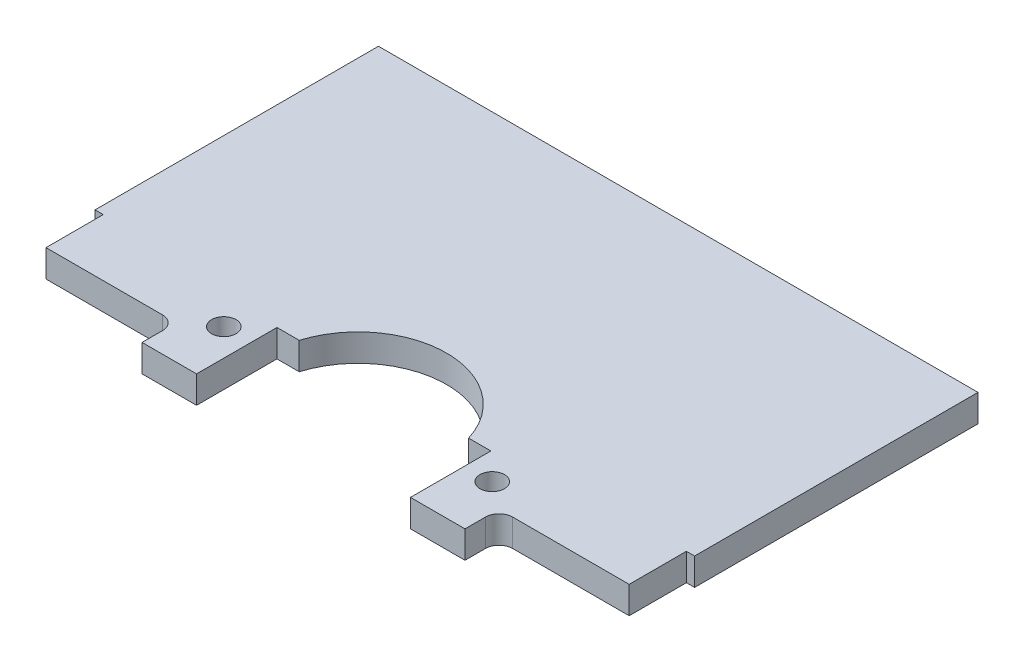
ISO-10303-21;
HEADER;
FILE_DESCRIPTION(('STEP AP214'),'2;1');
FILE_NAME('part.step','',(''),(''),'','','');
FILE_SCHEMA(('AUTOMOTIVE_DESIGN { 1 0 10303 214 1 1 1 1 }'));
ENDSEC;
DATA;
#1=APPLICATION_CONTEXT('core data for automotive mechanical design processes');
#2=APPLICATION_PROTOCOL_DEFINITION('international standard','automotive_design',2000,#1);
#3=PRODUCT_CONTEXT('',#1,'mechanical');
#4=PRODUCT('Part','Part','',(#3));
#5=PRODUCT_RELATED_PRODUCT_CATEGORY('part','',(#4));
#6=PRODUCT_DEFINITION_FORMATION('','',#4);
#7=PRODUCT_DEFINITION_CONTEXT('part definition',#1,'design');
#8=PRODUCT_DEFINITION('design','',#6,#7);
#9=PRODUCT_DEFINITION_SHAPE('','',#8);
#10=(LENGTH_UNIT() NAMED_UNIT(*) SI_UNIT(.MILLI.,.METRE.));
#11=(NAMED_UNIT(*) PLANE_ANGLE_UNIT() SI_UNIT($,.RADIAN.));
#12=(NAMED_UNIT(*) SI_UNIT($,.STERADIAN.) SOLID_ANGLE_UNIT());
#13=UNCERTAINTY_MEASURE_WITH_UNIT(LENGTH_MEASURE(1.E-05),#10,'distance_accuracy_value','');
#14=(GEOMETRIC_REPRESENTATION_CONTEXT(3) GLOBAL_UNCERTAINTY_ASSIGNED_CONTEXT((#13)) GLOBAL_UNIT_ASSIGNED_CONTEXT((#10,
#11,#12)) REPRESENTATION_CONTEXT('',''));
#15=CARTESIAN_POINT('',(0.,0.,0.));
#16=DIRECTION('',(0.,0.,1.));
#17=DIRECTION('',(1.,0.,0.));
#18=AXIS2_PLACEMENT_3D('',#15,#16,#17);
#19=CARTESIAN_POINT('',(0.,2.54,13.208));
#20=DIRECTION('',(0.,0.,-1.));
#21=DIRECTION('',(-1.,0.,0.));
#22=AXIS2_PLACEMENT_3D('',#19,#20,#21);
#23=PLANE('',#22);
#24=DIRECTION('',(1.,0.,0.));
#25=VECTOR('',#24,1.);
#26=CARTESIAN_POINT('',(0.,0.,13.208));
#27=LINE('',#26,#25);
#28=CARTESIAN_POINT('',(-27.94,0.,13.208));
#29=VERTEX_POINT('',#28);
#30=CARTESIAN_POINT('',(-27.178,0.,13.208));
#31=VERTEX_POINT('',#30);
#32=EDGE_CURVE('E191',#29,#31,#27,.T.);
#33=ORIENTED_EDGE('',*,*,#32,.T.);
#34=DIRECTION('',(0.,-1.,0.));
#35=VECTOR('',#34,1.);
#36=CARTESIAN_POINT('',(-27.178,2.54,13.208));
#37=LINE('',#36,#35);
#38=CARTESIAN_POINT('',(-27.178,2.54,13.208));
#39=VERTEX_POINT('',#38);
#40=EDGE_CURVE('E189',#39,#31,#37,.T.);
#41=ORIENTED_EDGE('',*,*,#40,.F.);
#42=DIRECTION('',(1.,0.,0.));
#43=VECTOR('',#42,1.);
#44=CARTESIAN_POINT('',(0.,2.54,13.208));
#45=LINE('',#44,#43);
#46=CARTESIAN_POINT('',(-27.94,2.54,13.208));
#47=VERTEX_POINT('',#46);
#48=EDGE_CURVE('E174',#47,#39,#45,.T.);
#49=ORIENTED_EDGE('',*,*,#48,.F.);
#50=DIRECTION('',(0.,-1.,0.));
#51=VECTOR('',#50,1.);
#52=CARTESIAN_POINT('',(-27.94,2.54,13.208));
#53=LINE('',#52,#51);
#54=EDGE_CURVE('E239',#47,#29,#53,.T.);
#55=ORIENTED_EDGE('',*,*,#54,.T.);
#56=EDGE_LOOP('',(#33,#41,#49,#55));
#57=FACE_BOUND('',#56,.T.);
#58=ADVANCED_FACE('F36',(#57),#23,.F.);
#59=CARTESIAN_POINT('',(-27.178,2.54,0.));
#60=DIRECTION('',(-1.,0.,0.));
#61=DIRECTION('',(0.,0.,1.));
#62=AXIS2_PLACEMENT_3D('',#59,#60,#61);
#63=PLANE('',#62);
#64=DIRECTION('',(0.,0.,-1.));
#65=VECTOR('',#64,1.);
#66=CARTESIAN_POINT('',(-27.178,0.,0.));
#67=LINE('',#66,#65);
#68=CARTESIAN_POINT('',(-27.178,0.,18.542));
#69=VERTEX_POINT('',#68);
#70=EDGE_CURVE('E241',#69,#31,#67,.T.);
#71=ORIENTED_EDGE('',*,*,#70,.F.);
#72=DIRECTION('',(0.,-1.,0.));
#73=VECTOR('',#72,1.);
#74=CARTESIAN_POINT('',(-27.178,2.54,18.542));
#75=LINE('',#74,#73);
#76=CARTESIAN_POINT('',(-27.178,2.54,18.542));
#77=VERTEX_POINT('',#76);
#78=EDGE_CURVE('E196',#77,#69,#75,.T.);
#79=ORIENTED_EDGE('',*,*,#78,.F.);
#80=DIRECTION('',(0.,0.,-1.));
#81=VECTOR('',#80,1.);
#82=CARTESIAN_POINT('',(-27.178,2.54,0.));
#83=LINE('',#82,#81);
#84=EDGE_CURVE('E180',#77,#39,#83,.T.);
#85=ORIENTED_EDGE('',*,*,#84,.T.);
#86=ORIENTED_EDGE('',*,*,#40,.T.);
#87=EDGE_LOOP('',(#71,#79,#85,#86));
#88=FACE_BOUND('',#87,.T.);
#89=ADVANCED_FACE('F198',(#88),#63,.T.);
#90=CARTESIAN_POINT('',(0.,2.54,18.542));
#91=DIRECTION('',(0.,0.,-1.));
#92=DIRECTION('',(-1.,0.,0.));
#93=AXIS2_PLACEMENT_3D('',#90,#91,#92);
#94=PLANE('',#93);
#95=DIRECTION('',(1.,0.,0.));
#96=VECTOR('',#95,1.);
#97=CARTESIAN_POINT('',(0.,0.,18.542));
#98=LINE('',#97,#96);
#99=CARTESIAN_POINT('',(-16.3195,0.,18.542));
#100=VERTEX_POINT('',#99);
#101=EDGE_CURVE('E244',#69,#100,#98,.T.);
#102=ORIENTED_EDGE('',*,*,#101,.T.);
#103=DIRECTION('',(0.,-1.,0.));
#104=VECTOR('',#103,1.);
#105=CARTESIAN_POINT('',(-16.3195,2.54,18.542));
#106=LINE('',#105,#104);
#107=CARTESIAN_POINT('',(-16.3195,2.54,18.542));
#108=VERTEX_POINT('',#107);
#109=EDGE_CURVE('E324',#100,#108,#106,.F.);
#110=ORIENTED_EDGE('',*,*,#109,.T.);
#111=DIRECTION('',(1.,0.,0.));
#112=VECTOR('',#111,1.);
#113=CARTESIAN_POINT('',(0.,2.54,18.542));
#114=LINE('',#113,#112);
#115=EDGE_CURVE('E200',#77,#108,#114,.T.);
#116=ORIENTED_EDGE('',*,*,#115,.F.);
#117=ORIENTED_EDGE('',*,*,#78,.T.);
#118=EDGE_LOOP('',(#102,#110,#116,#117));
#119=FACE_BOUND('',#118,.T.);
#120=ADVANCED_FACE('F348',(#119),#94,.F.);
#121=CARTESIAN_POINT('',(-15.0495,2.54,0.));
#122=DIRECTION('',(-1.,0.,0.));
#123=DIRECTION('',(0.,0.,1.));
#124=AXIS2_PLACEMENT_3D('',#121,#122,#123);
#125=PLANE('',#124);
#126=DIRECTION('',(0.,0.,-1.));
#127=VECTOR('',#126,1.);
#128=CARTESIAN_POINT('',(-15.0495,2.54,0.));
#129=LINE('',#128,#127);
#130=CARTESIAN_POINT('',(-15.0495,2.54,21.717));
#131=VERTEX_POINT('',#130);
#132=CARTESIAN_POINT('',(-15.0495,2.54,19.812));
#133=VERTEX_POINT('',#132);
#134=EDGE_CURVE('E202',#131,#133,#129,.T.);
#135=ORIENTED_EDGE('',*,*,#134,.T.);
#136=DIRECTION('',(0.,-1.,0.));
#137=VECTOR('',#136,1.);
#138=CARTESIAN_POINT('',(-15.0495,2.54,19.812));
#139=LINE('',#138,#137);
#140=CARTESIAN_POINT('',(-15.0495,0.,19.812));
#141=VERTEX_POINT('',#140);
#142=EDGE_CURVE('E195',#133,#141,#139,.T.);
#143=ORIENTED_EDGE('',*,*,#142,.T.);
#144=DIRECTION('',(0.,0.,-1.));
#145=VECTOR('',#144,1.);
#146=CARTESIAN_POINT('',(-15.0495,0.,0.));
#147=LINE('',#146,#145);
#148=CARTESIAN_POINT('',(-15.0495,0.,21.717));
#149=VERTEX_POINT('',#148);
#150=EDGE_CURVE('E247',#149,#141,#147,.T.);
#151=ORIENTED_EDGE('',*,*,#150,.F.);
#152=DIRECTION('',(0.,-1.,0.));
#153=VECTOR('',#152,1.);
#154=CARTESIAN_POINT('',(-15.0495,2.54,21.717));
#155=LINE('',#154,#153);
#156=EDGE_CURVE('E319',#131,#149,#155,.T.);
#157=ORIENTED_EDGE('',*,*,#156,.F.);
#158=EDGE_LOOP('',(#135,#143,#151,#157));
#159=FACE_BOUND('',#158,.T.);
#160=ADVANCED_FACE('F339',(#159),#125,.T.);
#161=CARTESIAN_POINT('',(0.,2.54,21.717));
#162=DIRECTION('',(0.,0.,-1.));
#163=DIRECTION('',(-1.,0.,0.));
#164=AXIS2_PLACEMENT_3D('',#161,#162,#163);
#165=PLANE('',#164);
#166=DIRECTION('',(1.,0.,0.));
#167=VECTOR('',#166,1.);
#168=CARTESIAN_POINT('',(0.,0.,21.717));
#169=LINE('',#168,#167);
#170=CARTESIAN_POINT('',(-9.9695,0.,21.717));
#171=VERTEX_POINT('',#170);
#172=EDGE_CURVE('E250',#149,#171,#169,.T.);
#173=ORIENTED_EDGE('',*,*,#172,.T.);
#174=DIRECTION('',(0.,-1.,0.));
#175=VECTOR('',#174,1.);
#176=CARTESIAN_POINT('',(-9.9695,2.54,21.717));
#177=LINE('',#176,#175);
#178=CARTESIAN_POINT('',(-9.9695,2.54,21.717));
#179=VERTEX_POINT('',#178);
#180=EDGE_CURVE('E316',#179,#171,#177,.T.);
#181=ORIENTED_EDGE('',*,*,#180,.F.);
#182=DIRECTION('',(1.,0.,0.));
#183=VECTOR('',#182,1.);
#184=CARTESIAN_POINT('',(0.,2.54,21.717));
#185=LINE('',#184,#183);
#186=EDGE_CURVE('E207',#131,#179,#185,.T.);
#187=ORIENTED_EDGE('',*,*,#186,.F.);
#188=ORIENTED_EDGE('',*,*,#156,.T.);
#189=EDGE_LOOP('',(#173,#181,#187,#188));
#190=FACE_BOUND('',#189,.T.);
#191=ADVANCED_FACE('F355',(#190),#165,.F.);
#192=CARTESIAN_POINT('',(-9.9695,2.54,0.));
#193=DIRECTION('',(-1.,0.,0.));
#194=DIRECTION('',(0.,0.,1.));
#195=AXIS2_PLACEMENT_3D('',#192,#193,#194);
#196=PLANE('',#195);
#197=DIRECTION('',(0.,0.,-1.));
#198=VECTOR('',#197,1.);
#199=CARTESIAN_POINT('',(-9.9695,0.,0.));
#200=LINE('',#199,#198);
#201=CARTESIAN_POINT('',(-9.9695,0.,14.224));
#202=VERTEX_POINT('',#201);
#203=EDGE_CURVE('E252',#171,#202,#200,.T.);
#204=ORIENTED_EDGE('',*,*,#203,.T.);
#205=DIRECTION('',(0.,-1.,0.));
#206=VECTOR('',#205,1.);
#207=CARTESIAN_POINT('',(-9.9695,2.54,14.224));
#208=LINE('',#207,#206);
#209=CARTESIAN_POINT('',(-9.9695,2.54,14.224));
#210=VERTEX_POINT('',#209);
#211=EDGE_CURVE('E313',#210,#202,#208,.T.);
#212=ORIENTED_EDGE('',*,*,#211,.F.);
#213=DIRECTION('',(0.,0.,-1.));
#214=VECTOR('',#213,1.);
#215=CARTESIAN_POINT('',(-9.9695,2.54,0.));
#216=LINE('',#215,#214);
#217=EDGE_CURVE('E209',#179,#210,#216,.T.);
#218=ORIENTED_EDGE('',*,*,#217,.F.);
#219=ORIENTED_EDGE('',*,*,#180,.T.);
#220=EDGE_LOOP('',(#204,#212,#218,#219));
#221=FACE_BOUND('',#220,.T.);
#222=ADVANCED_FACE('F530',(#221),#196,.F.);
#223=CARTESIAN_POINT('',(0.,2.54,14.224));
#224=DIRECTION('',(0.,0.,-1.));
#225=DIRECTION('',(-1.,0.,0.));
#226=AXIS2_PLACEMENT_3D('',#223,#224,#225);
#227=PLANE('',#226);
#228=DIRECTION('',(1.,0.,0.));
#229=VECTOR('',#228,1.);
#230=CARTESIAN_POINT('',(0.,0.,14.224));
#231=LINE('',#230,#229);
#232=CARTESIAN_POINT('',(-7.89445729610339,0.,14.224));
#233=VERTEX_POINT('',#232);
#234=EDGE_CURVE('E254',#202,#233,#231,.T.);
#235=ORIENTED_EDGE('',*,*,#234,.T.);
#236=DIRECTION('',(0.,-1.,0.));
#237=VECTOR('',#236,1.);
#238=CARTESIAN_POINT('',(-7.89445729610339,2.54,14.224));
#239=LINE('',#238,#237);
#240=CARTESIAN_POINT('',(-7.89445729610339,2.54,14.224));
#241=VERTEX_POINT('',#240);
#242=EDGE_CURVE('E310',#241,#233,#239,.T.);
#243=ORIENTED_EDGE('',*,*,#242,.F.);
#244=DIRECTION('',(1.,0.,0.));
#245=VECTOR('',#244,1.);
#246=CARTESIAN_POINT('',(0.,2.54,14.224));
#247=LINE('',#246,#245);
#248=EDGE_CURVE('E211',#210,#241,#247,.T.);
#249=ORIENTED_EDGE('',*,*,#248,.F.);
#250=ORIENTED_EDGE('',*,*,#211,.T.);
#251=EDGE_LOOP('',(#235,#243,#249,#250));
#252=FACE_BOUND('',#251,.T.);
#253=ADVANCED_FACE('F526',(#252),#227,.F.);
#254=CARTESIAN_POINT('',(0.,2.54,16.637));
#255=DIRECTION('',(0.,-1.,0.));
#256=DIRECTION('',(0.,0.,-1.));
#257=AXIS2_PLACEMENT_3D('',#254,#255,#256);
#258=CYLINDRICAL_SURFACE('',#257,8.255);
#259=CARTESIAN_POINT('',(0.,0.,16.637));
#260=DIRECTION('',(0.,1.,0.));
#261=DIRECTION('',(0.,0.,1.));
#262=AXIS2_PLACEMENT_3D('',#259,#260,#261);
#263=CIRCLE('',#262,8.255);
#264=CARTESIAN_POINT('',(7.89445729610339,0.,14.224));
#265=VERTEX_POINT('',#264);
#266=EDGE_CURVE('E256',#233,#265,#263,.F.);
#267=ORIENTED_EDGE('',*,*,#266,.T.);
#268=DIRECTION('',(0.,-1.,0.));
#269=VECTOR('',#268,1.);
#270=CARTESIAN_POINT('',(7.89445729610339,2.54,14.224));
#271=LINE('',#270,#269);
#272=CARTESIAN_POINT('',(7.89445729610339,2.54,14.224));
#273=VERTEX_POINT('',#272);
#274=EDGE_CURVE('E307',#273,#265,#271,.T.);
#275=ORIENTED_EDGE('',*,*,#274,.F.);
#276=CARTESIAN_POINT('',(0.,2.54,16.637));
#277=DIRECTION('',(0.,1.,0.));
#278=DIRECTION('',(0.,0.,1.));
#279=AXIS2_PLACEMENT_3D('',#276,#277,#278);
#280=CIRCLE('',#279,8.255);
#281=EDGE_CURVE('E213',#241,#273,#280,.F.);
#282=ORIENTED_EDGE('',*,*,#281,.F.);
#283=ORIENTED_EDGE('',*,*,#242,.T.);
#284=EDGE_LOOP('',(#267,#275,#282,#283));
#285=FACE_BOUND('',#284,.T.);
#286=ADVANCED_FACE('F521',(#285),#258,.F.);
#287=CARTESIAN_POINT('',(0.,2.54,14.224));
#288=DIRECTION('',(0.,0.,-1.));
#289=DIRECTION('',(-1.,0.,0.));
#290=AXIS2_PLACEMENT_3D('',#287,#288,#289);
#291=PLANE('',#290);
#292=DIRECTION('',(1.,0.,0.));
#293=VECTOR('',#292,1.);
#294=CARTESIAN_POINT('',(0.,0.,14.224));
#295=LINE('',#294,#293);
#296=CARTESIAN_POINT('',(9.9695,0.,14.224));
#297=VERTEX_POINT('',#296);
#298=EDGE_CURVE('E258',#265,#297,#295,.T.);
#299=ORIENTED_EDGE('',*,*,#298,.T.);
#300=DIRECTION('',(0.,-1.,0.));
#301=VECTOR('',#300,1.);
#302=CARTESIAN_POINT('',(9.9695,2.54,14.224));
#303=LINE('',#302,#301);
#304=CARTESIAN_POINT('',(9.9695,2.54,14.224));
#305=VERTEX_POINT('',#304);
#306=EDGE_CURVE('E304',#305,#297,#303,.T.);
#307=ORIENTED_EDGE('',*,*,#306,.F.);
#308=DIRECTION('',(1.,0.,0.));
#309=VECTOR('',#308,1.);
#310=CARTESIAN_POINT('',(0.,2.54,14.224));
#311=LINE('',#310,#309);
#312=EDGE_CURVE('E215',#273,#305,#311,.T.);
#313=ORIENTED_EDGE('',*,*,#312,.F.);
#314=ORIENTED_EDGE('',*,*,#274,.T.);
#315=EDGE_LOOP('',(#299,#307,#313,#314));
#316=FACE_BOUND('',#315,.T.);
#317=ADVANCED_FACE('F515',(#316),#291,.F.);
#318=CARTESIAN_POINT('',(9.9695,2.54,0.));
#319=DIRECTION('',(1.,0.,0.));
#320=DIRECTION('',(0.,0.,-1.));
#321=AXIS2_PLACEMENT_3D('',#318,#319,#320);
#322=PLANE('',#321);
#323=DIRECTION('',(0.,0.,1.));
#324=VECTOR('',#323,1.);
#325=CARTESIAN_POINT('',(9.9695,0.,0.));
#326=LINE('',#325,#324);
#327=CARTESIAN_POINT('',(9.9695,0.,21.717));
#328=VERTEX_POINT('',#327);
#329=EDGE_CURVE('E260',#297,#328,#326,.T.);
#330=ORIENTED_EDGE('',*,*,#329,.T.);
#331=DIRECTION('',(0.,-1.,0.));
#332=VECTOR('',#331,1.);
#333=CARTESIAN_POINT('',(9.9695,2.54,21.717));
#334=LINE('',#333,#332);
#335=CARTESIAN_POINT('',(9.9695,2.54,21.717));
#336=VERTEX_POINT('',#335);
#337=EDGE_CURVE('E301',#336,#328,#334,.T.);
#338=ORIENTED_EDGE('',*,*,#337,.F.);
#339=DIRECTION('',(0.,0.,1.));
#340=VECTOR('',#339,1.);
#341=CARTESIAN_POINT('',(9.9695,2.54,0.));
#342=LINE('',#341,#340);
#343=EDGE_CURVE('E217',#305,#336,#342,.T.);
#344=ORIENTED_EDGE('',*,*,#343,.F.);
#345=ORIENTED_EDGE('',*,*,#306,.T.);
#346=EDGE_LOOP('',(#330,#338,#344,#345));
#347=FACE_BOUND('',#346,.T.);
#348=ADVANCED_FACE('F511',(#347),#322,.F.);
#349=CARTESIAN_POINT('',(0.,2.54,21.717));
#350=DIRECTION('',(0.,0.,-1.));
#351=DIRECTION('',(-1.,0.,0.));
#352=AXIS2_PLACEMENT_3D('',#349,#350,#351);
#353=PLANE('',#352);
#354=DIRECTION('',(1.,0.,0.));
#355=VECTOR('',#354,1.);
#356=CARTESIAN_POINT('',(0.,0.,21.717));
#357=LINE('',#356,#355);
#358=CARTESIAN_POINT('',(15.0495,0.,21.717));
#359=VERTEX_POINT('',#358);
#360=EDGE_CURVE('E262',#328,#359,#357,.T.);
#361=ORIENTED_EDGE('',*,*,#360,.T.);
#362=DIRECTION('',(0.,-1.,0.));
#363=VECTOR('',#362,1.);
#364=CARTESIAN_POINT('',(15.0495,2.54,21.717));
#365=LINE('',#364,#363);
#366=CARTESIAN_POINT('',(15.0495,2.54,21.717));
#367=VERTEX_POINT('',#366);
#368=EDGE_CURVE('E298',#367,#359,#365,.T.);
#369=ORIENTED_EDGE('',*,*,#368,.F.);
#370=DIRECTION('',(1.,0.,0.));
#371=VECTOR('',#370,1.);
#372=CARTESIAN_POINT('',(0.,2.54,21.717));
#373=LINE('',#372,#371);
#374=EDGE_CURVE('E219',#336,#367,#373,.T.);
#375=ORIENTED_EDGE('',*,*,#374,.F.);
#376=ORIENTED_EDGE('',*,*,#337,.T.);
#377=EDGE_LOOP('',(#361,#369,#375,#376));
#378=FACE_BOUND('',#377,.T.);
#379=ADVANCED_FACE('F447',(#378),#353,.F.);
#380=CARTESIAN_POINT('',(15.0495,2.54,0.));
#381=DIRECTION('',(-1.,0.,0.));
#382=DIRECTION('',(0.,0.,1.));
#383=AXIS2_PLACEMENT_3D('',#380,#381,#382);
#384=PLANE('',#383);
#385=DIRECTION('',(0.,0.,-1.));
#386=VECTOR('',#385,1.);
#387=CARTESIAN_POINT('',(15.0495,0.,0.));
#388=LINE('',#387,#386);
#389=CARTESIAN_POINT('',(15.0495,0.,19.812));
#390=VERTEX_POINT('',#389);
#391=EDGE_CURVE('E264',#359,#390,#388,.T.);
#392=ORIENTED_EDGE('',*,*,#391,.T.);
#393=DIRECTION('',(0.,-1.,0.));
#394=VECTOR('',#393,1.);
#395=CARTESIAN_POINT('',(15.0495,2.54,19.812));
#396=LINE('',#395,#394);
#397=CARTESIAN_POINT('',(15.0495,2.54,19.812));
#398=VERTEX_POINT('',#397);
#399=EDGE_CURVE('E51',#390,#398,#396,.F.);
#400=ORIENTED_EDGE('',*,*,#399,.T.);
#401=DIRECTION('',(0.,0.,-1.));
#402=VECTOR('',#401,1.);
#403=CARTESIAN_POINT('',(15.0495,2.54,0.));
#404=LINE('',#403,#402);
#405=EDGE_CURVE('E221',#367,#398,#404,.T.);
#406=ORIENTED_EDGE('',*,*,#405,.F.);
#407=ORIENTED_EDGE('',*,*,#368,.T.);
#408=EDGE_LOOP('',(#392,#400,#406,#407));
#409=FACE_BOUND('',#408,.T.);
#410=ADVANCED_FACE('F442',(#409),#384,.F.);
#411=CARTESIAN_POINT('',(0.,2.54,18.542));
#412=DIRECTION('',(0.,0.,-1.));
#413=DIRECTION('',(-1.,0.,0.));
#414=AXIS2_PLACEMENT_3D('',#411,#412,#413);
#415=PLANE('',#414);
#416=DIRECTION('',(1.,0.,0.));
#417=VECTOR('',#416,1.);
#418=CARTESIAN_POINT('',(0.,2.54,18.542));
#419=LINE('',#418,#417);
#420=CARTESIAN_POINT('',(16.3195,2.54,18.542));
#421=VERTEX_POINT('',#420);
#422=CARTESIAN_POINT('',(27.178,2.54,18.542));
#423=VERTEX_POINT('',#422);
#424=EDGE_CURVE('E223',#421,#423,#419,.T.);
#425=ORIENTED_EDGE('',*,*,#424,.F.);
#426=DIRECTION('',(0.,-1.,0.));
#427=VECTOR('',#426,1.);
#428=CARTESIAN_POINT('',(16.3195,0.,18.542));
#429=LINE('',#428,#427);
#430=CARTESIAN_POINT('',(16.3195,0.,18.542));
#431=VERTEX_POINT('',#430);
#432=EDGE_CURVE('E326',#421,#431,#429,.T.);
#433=ORIENTED_EDGE('',*,*,#432,.T.);
#434=DIRECTION('',(1.,0.,0.));
#435=VECTOR('',#434,1.);
#436=CARTESIAN_POINT('',(0.,0.,18.542));
#437=LINE('',#436,#435);
#438=CARTESIAN_POINT('',(27.178,0.,18.542));
#439=VERTEX_POINT('',#438);
#440=EDGE_CURVE('E266',#431,#439,#437,.T.);
#441=ORIENTED_EDGE('',*,*,#440,.T.);
#442=DIRECTION('',(0.,-1.,0.));
#443=VECTOR('',#442,1.);
#444=CARTESIAN_POINT('',(27.178,2.54,18.542));
#445=LINE('',#444,#443);
#446=EDGE_CURVE('E295',#423,#439,#445,.T.);
#447=ORIENTED_EDGE('',*,*,#446,.F.);
#448=EDGE_LOOP('',(#425,#433,#441,#447));
#449=FACE_BOUND('',#448,.T.);
#450=ADVANCED_FACE('F375',(#449),#415,.F.);
#451=CARTESIAN_POINT('',(27.178,2.54,0.));
#452=DIRECTION('',(-1.,0.,0.));
#453=DIRECTION('',(0.,0.,1.));
#454=AXIS2_PLACEMENT_3D('',#451,#452,#453);
#455=PLANE('',#454);
#456=DIRECTION('',(0.,0.,-1.));
#457=VECTOR('',#456,1.);
#458=CARTESIAN_POINT('',(27.178,0.,0.));
#459=LINE('',#458,#457);
#460=CARTESIAN_POINT('',(27.178,0.,13.208));
#461=VERTEX_POINT('',#460);
#462=EDGE_CURVE('E268',#439,#461,#459,.T.);
#463=ORIENTED_EDGE('',*,*,#462,.T.);
#464=DIRECTION('',(0.,-1.,0.));
#465=VECTOR('',#464,1.);
#466=CARTESIAN_POINT('',(27.178,2.54,13.208));
#467=LINE('',#466,#465);
#468=CARTESIAN_POINT('',(27.178,2.54,13.208));
#469=VERTEX_POINT('',#468);
#470=EDGE_CURVE('E292',#469,#461,#467,.T.);
#471=ORIENTED_EDGE('',*,*,#470,.F.);
#472=DIRECTION('',(0.,0.,-1.));
#473=VECTOR('',#472,1.);
#474=CARTESIAN_POINT('',(27.178,2.54,0.));
#475=LINE('',#474,#473);
#476=EDGE_CURVE('E225',#423,#469,#475,.T.);
#477=ORIENTED_EDGE('',*,*,#476,.F.);
#478=ORIENTED_EDGE('',*,*,#446,.T.);
#479=EDGE_LOOP('',(#463,#471,#477,#478));
#480=FACE_BOUND('',#479,.T.);
#481=ADVANCED_FACE('F367',(#480),#455,.F.);
#482=CARTESIAN_POINT('',(27.94,0.,13.208));
#483=VERTEX_POINT('',#482);
#484=EDGE_CURVE('E242',#461,#483,#27,.T.);
#485=ORIENTED_EDGE('',*,*,#484,.T.);
#486=DIRECTION('',(0.,-1.,0.));
#487=VECTOR('',#486,1.);
#488=CARTESIAN_POINT('',(27.94,2.54,13.208));
#489=LINE('',#488,#487);
#490=CARTESIAN_POINT('',(27.94,2.54,13.208));
#491=VERTEX_POINT('',#490);
#492=EDGE_CURVE('E289',#491,#483,#489,.T.);
#493=ORIENTED_EDGE('',*,*,#492,.F.);
#494=EDGE_CURVE('E187',#469,#491,#45,.T.);
#495=ORIENTED_EDGE('',*,*,#494,.F.);
#496=ORIENTED_EDGE('',*,*,#470,.T.);
#497=EDGE_LOOP('',(#485,#493,#495,#496));
#498=FACE_BOUND('',#497,.T.);
#499=ADVANCED_FACE('F360',(#498),#23,.F.);
#500=CARTESIAN_POINT('',(27.94,2.54,0.));
#501=DIRECTION('',(-1.,0.,0.));
#502=DIRECTION('',(0.,0.,1.));
#503=AXIS2_PLACEMENT_3D('',#500,#501,#502);
#504=PLANE('',#503);
#505=DIRECTION('',(0.,0.,-1.));
#506=VECTOR('',#505,1.);
#507=CARTESIAN_POINT('',(27.94,0.,0.));
#508=LINE('',#507,#506);
#509=CARTESIAN_POINT('',(27.94,0.,-13.208));
#510=VERTEX_POINT('',#509);
#511=EDGE_CURVE('E270',#483,#510,#508,.T.);
#512=ORIENTED_EDGE('',*,*,#511,.T.);
#513=DIRECTION('',(0.,-1.,0.));
#514=VECTOR('',#513,1.);
#515=CARTESIAN_POINT('',(27.94,2.54,-13.208));
#516=LINE('',#515,#514);
#517=CARTESIAN_POINT('',(27.94,2.54,-13.208));
#518=VERTEX_POINT('',#517);
#519=EDGE_CURVE('E287',#518,#510,#516,.T.);
#520=ORIENTED_EDGE('',*,*,#519,.F.);
#521=DIRECTION('',(0.,0.,-1.));
#522=VECTOR('',#521,1.);
#523=CARTESIAN_POINT('',(27.94,2.54,0.));
#524=LINE('',#523,#522);
#525=EDGE_CURVE('E227',#491,#518,#524,.T.);
#526=ORIENTED_EDGE('',*,*,#525,.F.);
#527=ORIENTED_EDGE('',*,*,#492,.T.);
#528=EDGE_LOOP('',(#512,#520,#526,#527));
#529=FACE_BOUND('',#528,.T.);
#530=ADVANCED_FACE('F366',(#529),#504,.F.);
#531=CARTESIAN_POINT('',(0.,2.54,-13.208));
#532=DIRECTION('',(0.,0.,-1.));
#533=DIRECTION('',(-1.,0.,0.));
#534=AXIS2_PLACEMENT_3D('',#531,#532,#533);
#535=PLANE('',#534);
#536=DIRECTION('',(1.,0.,0.));
#537=VECTOR('',#536,1.);
#538=CARTESIAN_POINT('',(0.,0.,-13.208));
#539=LINE('',#538,#537);
#540=CARTESIAN_POINT('',(-27.94,0.,-13.208));
#541=VERTEX_POINT('',#540);
#542=EDGE_CURVE('E273',#541,#510,#539,.T.);
#543=ORIENTED_EDGE('',*,*,#542,.F.);
#544=DIRECTION('',(0.,-1.,0.));
#545=VECTOR('',#544,1.);
#546=CARTESIAN_POINT('',(-27.94,2.54,-13.208));
#547=LINE('',#546,#545);
#548=CARTESIAN_POINT('',(-27.94,2.54,-13.208));
#549=VERTEX_POINT('',#548);
#550=EDGE_CURVE('E285',#549,#541,#547,.T.);
#551=ORIENTED_EDGE('',*,*,#550,.F.);
#552=DIRECTION('',(1.,0.,0.));
#553=VECTOR('',#552,1.);
#554=CARTESIAN_POINT('',(0.,2.54,-13.208));
#555=LINE('',#554,#553);
#556=EDGE_CURVE('E229',#549,#518,#555,.T.);
#557=ORIENTED_EDGE('',*,*,#556,.T.);
#558=ORIENTED_EDGE('',*,*,#519,.T.);
#559=EDGE_LOOP('',(#543,#551,#557,#558));
#560=FACE_BOUND('',#559,.T.);
#561=ADVANCED_FACE('F373',(#560),#535,.T.);
#562=CARTESIAN_POINT('',(12.5095,2.54,16.637));
#563=DIRECTION('',(0.,-1.,0.));
#564=DIRECTION('',(0.,0.,-1.));
#565=AXIS2_PLACEMENT_3D('',#562,#563,#564);
#566=CYLINDRICAL_SURFACE('',#565,1.143);
#567=CARTESIAN_POINT('',(12.5095,2.54,16.637));
#568=DIRECTION('',(0.,1.,0.));
#569=DIRECTION('',(0.,0.,1.));
#570=AXIS2_PLACEMENT_3D('',#567,#568,#569);
#571=CIRCLE('',#570,1.143);
#572=CARTESIAN_POINT('',(12.5095,2.54,17.78));
#573=VERTEX_POINT('',#572);
#574=EDGE_CURVE('E233',#573,#573,#571,.T.);
#575=ORIENTED_EDGE('',*,*,#574,.T.);
#576=EDGE_LOOP('',(#575));
#577=FACE_BOUND('',#576,.T.);
#578=CARTESIAN_POINT('',(12.5095,0.,16.637));
#579=DIRECTION('',(0.,1.,0.));
#580=DIRECTION('',(0.,0.,1.));
#581=AXIS2_PLACEMENT_3D('',#578,#579,#580);
#582=CIRCLE('',#581,1.143);
#583=CARTESIAN_POINT('',(12.5095,0.,17.78));
#584=VERTEX_POINT('',#583);
#585=EDGE_CURVE('E279',#584,#584,#582,.T.);
#586=ORIENTED_EDGE('',*,*,#585,.F.);
#587=EDGE_LOOP('',(#586));
#588=FACE_BOUND('',#587,.T.);
#589=ADVANCED_FACE('F392',(#577,#588),#566,.F.);
#590=CARTESIAN_POINT('',(-27.94,2.54,0.));
#591=DIRECTION('',(-1.,0.,0.));
#592=DIRECTION('',(0.,0.,1.));
#593=AXIS2_PLACEMENT_3D('',#590,#591,#592);
#594=PLANE('',#593);
#595=DIRECTION('',(0.,0.,-1.));
#596=VECTOR('',#595,1.);
#597=CARTESIAN_POINT('',(-27.94,0.,0.));
#598=LINE('',#597,#596);
#599=EDGE_CURVE('E276',#29,#541,#598,.T.);
#600=ORIENTED_EDGE('',*,*,#599,.F.);
#601=ORIENTED_EDGE('',*,*,#54,.F.);
#602=DIRECTION('',(0.,0.,-1.));
#603=VECTOR('',#602,1.);
#604=CARTESIAN_POINT('',(-27.94,2.54,0.));
#605=LINE('',#604,#603);
#606=EDGE_CURVE('E183',#47,#549,#605,.T.);
#607=ORIENTED_EDGE('',*,*,#606,.T.);
#608=ORIENTED_EDGE('',*,*,#550,.T.);
#609=EDGE_LOOP('',(#600,#601,#607,#608));
#610=FACE_BOUND('',#609,.T.);
#611=ADVANCED_FACE('F389',(#610),#594,.T.);
#612=CARTESIAN_POINT('',(-12.5095,2.54,16.637));
#613=DIRECTION('',(0.,-1.,0.));
#614=DIRECTION('',(0.,0.,-1.));
#615=AXIS2_PLACEMENT_3D('',#612,#613,#614);
#616=CYLINDRICAL_SURFACE('',#615,1.143);
#617=CARTESIAN_POINT('',(-12.5095,2.54,16.637));
#618=DIRECTION('',(0.,1.,0.));
#619=DIRECTION('',(0.,0.,1.));
#620=AXIS2_PLACEMENT_3D('',#617,#618,#619);
#621=CIRCLE('',#620,1.143);
#622=CARTESIAN_POINT('',(-12.5095,2.54,17.78));
#623=VERTEX_POINT('',#622);
#624=EDGE_CURVE('E236',#623,#623,#621,.T.);
#625=ORIENTED_EDGE('',*,*,#624,.T.);
#626=EDGE_LOOP('',(#625));
#627=FACE_BOUND('',#626,.T.);
#628=CARTESIAN_POINT('',(-12.5095,0.,16.637));
#629=DIRECTION('',(0.,1.,0.));
#630=DIRECTION('',(0.,0.,1.));
#631=AXIS2_PLACEMENT_3D('',#628,#629,#630);
#632=CIRCLE('',#631,1.143);
#633=CARTESIAN_POINT('',(-12.5095,0.,17.78));
#634=VERTEX_POINT('',#633);
#635=EDGE_CURVE('E185',#634,#634,#632,.T.);
#636=ORIENTED_EDGE('',*,*,#635,.F.);
#637=EDGE_LOOP('',(#636));
#638=FACE_BOUND('',#637,.T.);
#639=ADVANCED_FACE('F391',(#627,#638),#616,.F.);
#640=CARTESIAN_POINT('',(0.,2.54,0.));
#641=DIRECTION('',(0.,1.,0.));
#642=DIRECTION('',(0.,0.,1.));
#643=AXIS2_PLACEMENT_3D('',#640,#641,#642);
#644=PLANE('',#643);
#645=ORIENTED_EDGE('',*,*,#48,.T.);
#646=ORIENTED_EDGE('',*,*,#84,.F.);
#647=ORIENTED_EDGE('',*,*,#115,.T.);
#648=CARTESIAN_POINT('',(-16.3195,2.54,19.812));
#649=DIRECTION('',(0.,1.,0.));
#650=DIRECTION('',(0.,0.,1.));
#651=AXIS2_PLACEMENT_3D('',#648,#649,#650);
#652=CIRCLE('',#651,1.27);
#653=EDGE_CURVE('E332',#108,#133,#652,.F.);
#654=ORIENTED_EDGE('',*,*,#653,.T.);
#655=ORIENTED_EDGE('',*,*,#134,.F.);
#656=ORIENTED_EDGE('',*,*,#186,.T.);
#657=ORIENTED_EDGE('',*,*,#217,.T.);
#658=ORIENTED_EDGE('',*,*,#248,.T.);
#659=ORIENTED_EDGE('',*,*,#281,.T.);
#660=ORIENTED_EDGE('',*,*,#312,.T.);
#661=ORIENTED_EDGE('',*,*,#343,.T.);
#662=ORIENTED_EDGE('',*,*,#374,.T.);
#663=ORIENTED_EDGE('',*,*,#405,.T.);
#664=CARTESIAN_POINT('',(16.3195,2.54,19.812));
#665=DIRECTION('',(0.,1.,0.));
#666=DIRECTION('',(0.,0.,1.));
#667=AXIS2_PLACEMENT_3D('',#664,#665,#666);
#668=CIRCLE('',#667,1.27);
#669=EDGE_CURVE('E11',#398,#421,#668,.F.);
#670=ORIENTED_EDGE('',*,*,#669,.T.);
#671=ORIENTED_EDGE('',*,*,#424,.T.);
#672=ORIENTED_EDGE('',*,*,#476,.T.);
#673=ORIENTED_EDGE('',*,*,#494,.T.);
#674=ORIENTED_EDGE('',*,*,#525,.T.);
#675=ORIENTED_EDGE('',*,*,#556,.F.);
#676=ORIENTED_EDGE('',*,*,#606,.F.);
#677=EDGE_LOOP('',(#645,#646,#647,#654,#655,#656,#657,#658,#659,#660,#661,#662,#663,#670,#671,
#672,#673,#674,#675,#676));
#678=FACE_BOUND('',#677,.T.);
#679=ORIENTED_EDGE('',*,*,#574,.F.);
#680=EDGE_LOOP('',(#679));
#681=FACE_BOUND('',#680,.T.);
#682=ORIENTED_EDGE('',*,*,#624,.F.);
#683=EDGE_LOOP('',(#682));
#684=FACE_BOUND('',#683,.T.);
#685=ADVANCED_FACE('F176',(#678,#681,#684),#644,.T.);
#686=CARTESIAN_POINT('',(0.,0.,0.));
#687=DIRECTION('',(0.,1.,0.));
#688=DIRECTION('',(0.,0.,1.));
#689=AXIS2_PLACEMENT_3D('',#686,#687,#688);
#690=PLANE('',#689);
#691=ORIENTED_EDGE('',*,*,#32,.F.);
#692=ORIENTED_EDGE('',*,*,#599,.T.);
#693=ORIENTED_EDGE('',*,*,#542,.T.);
#694=ORIENTED_EDGE('',*,*,#511,.F.);
#695=ORIENTED_EDGE('',*,*,#484,.F.);
#696=ORIENTED_EDGE('',*,*,#462,.F.);
#697=ORIENTED_EDGE('',*,*,#440,.F.);
#698=CARTESIAN_POINT('',(16.3195,0.,19.812));
#699=DIRECTION('',(0.,1.,0.));
#700=DIRECTION('',(0.,0.,1.));
#701=AXIS2_PLACEMENT_3D('',#698,#699,#700);
#702=CIRCLE('',#701,1.27);
#703=EDGE_CURVE('E44',#431,#390,#702,.T.);
#704=ORIENTED_EDGE('',*,*,#703,.T.);
#705=ORIENTED_EDGE('',*,*,#391,.F.);
#706=ORIENTED_EDGE('',*,*,#360,.F.);
#707=ORIENTED_EDGE('',*,*,#329,.F.);
#708=ORIENTED_EDGE('',*,*,#298,.F.);
#709=ORIENTED_EDGE('',*,*,#266,.F.);
#710=ORIENTED_EDGE('',*,*,#234,.F.);
#711=ORIENTED_EDGE('',*,*,#203,.F.);
#712=ORIENTED_EDGE('',*,*,#172,.F.);
#713=ORIENTED_EDGE('',*,*,#150,.T.);
#714=CARTESIAN_POINT('',(-16.3195,0.,19.812));
#715=DIRECTION('',(0.,1.,0.));
#716=DIRECTION('',(0.,0.,1.));
#717=AXIS2_PLACEMENT_3D('',#714,#715,#716);
#718=CIRCLE('',#717,1.27);
#719=EDGE_CURVE('E330',#141,#100,#718,.T.);
#720=ORIENTED_EDGE('',*,*,#719,.T.);
#721=ORIENTED_EDGE('',*,*,#101,.F.);
#722=ORIENTED_EDGE('',*,*,#70,.T.);
#723=EDGE_LOOP('',(#691,#692,#693,#694,#695,#696,#697,#704,#705,#706,#707,#708,#709,#710,#711,
#712,#713,#720,#721,#722));
#724=FACE_BOUND('',#723,.T.);
#725=ORIENTED_EDGE('',*,*,#585,.T.);
#726=EDGE_LOOP('',(#725));
#727=FACE_BOUND('',#726,.T.);
#728=ORIENTED_EDGE('',*,*,#635,.T.);
#729=EDGE_LOOP('',(#728));
#730=FACE_BOUND('',#729,.T.);
#731=ADVANCED_FACE('F344',(#724,#727,#730),#690,.F.);
#732=CARTESIAN_POINT('',(-16.3195,2.54,19.812));
#733=DIRECTION('',(0.,-1.,0.));
#734=DIRECTION('',(0.,0.,-1.));
#735=AXIS2_PLACEMENT_3D('',#732,#733,#734);
#736=CYLINDRICAL_SURFACE('',#735,1.27);
#737=ORIENTED_EDGE('',*,*,#653,.F.);
#738=ORIENTED_EDGE('',*,*,#109,.F.);
#739=ORIENTED_EDGE('',*,*,#719,.F.);
#740=ORIENTED_EDGE('',*,*,#142,.F.);
#741=EDGE_LOOP('',(#737,#738,#739,#740));
#742=FACE_BOUND('',#741,.T.);
#743=ADVANCED_FACE('F342',(#742),#736,.F.);
#744=CARTESIAN_POINT('',(16.3195,2.54,19.812));
#745=DIRECTION('',(0.,1.,0.));
#746=DIRECTION('',(0.,0.,1.));
#747=AXIS2_PLACEMENT_3D('',#744,#745,#746);
#748=CYLINDRICAL_SURFACE('',#747,1.27);
#749=ORIENTED_EDGE('',*,*,#669,.F.);
#750=ORIENTED_EDGE('',*,*,#399,.F.);
#751=ORIENTED_EDGE('',*,*,#703,.F.);
#752=ORIENTED_EDGE('',*,*,#432,.F.);
#753=EDGE_LOOP('',(#749,#750,#751,#752));
#754=FACE_BOUND('',#753,.T.);
#755=ADVANCED_FACE('F38',(#754),#748,.F.);
#756=CLOSED_SHELL('',(#58,#89,#120,#160,#191,#222,#253,#286,#317,#348,#379,#410,#450,#481,#499,
#530,#561,#589,#611,#639,#685,#731,#743,#755));
#757=MANIFOLD_SOLID_BREP('B2',#756);
#758=ADVANCED_BREP_SHAPE_REPRESENTATION('',(#18,#757),#14);
#759=SHAPE_DEFINITION_REPRESENTATION(#9,#758);
ENDSEC;
END-ISO-10303-21;
